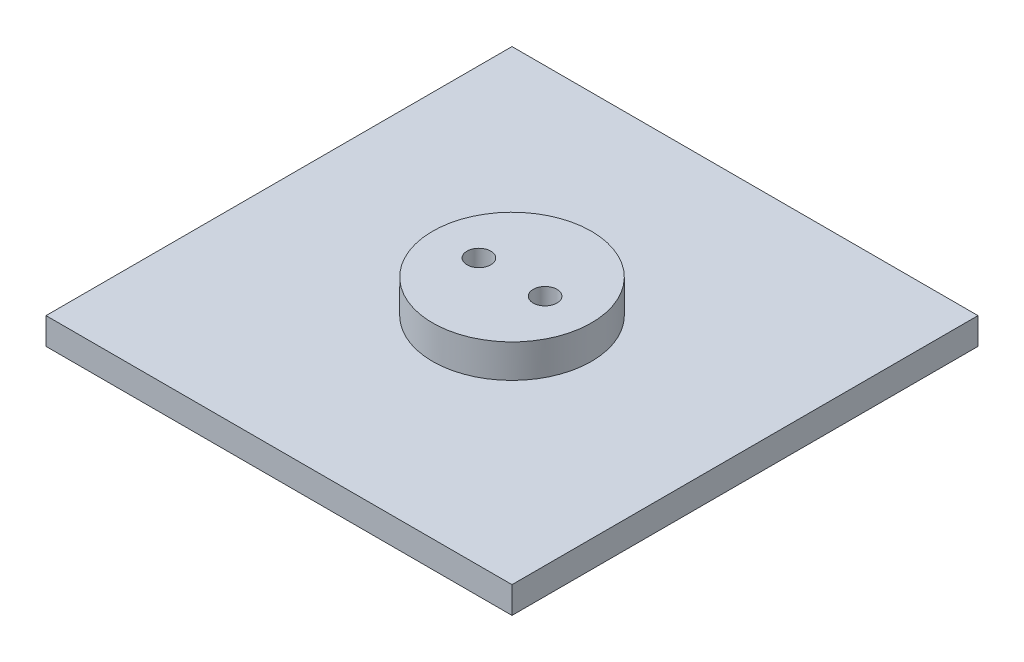
ISO-10303-21;
HEADER;
FILE_DESCRIPTION(('STEP AP214'),'2;1');
FILE_NAME('part.step','',(''),(''),'','','');
FILE_SCHEMA(('AUTOMOTIVE_DESIGN { 1 0 10303 214 1 1 1 1 }'));
ENDSEC;
DATA;
#1=APPLICATION_CONTEXT('core data for automotive mechanical design processes');
#2=APPLICATION_PROTOCOL_DEFINITION('international standard','automotive_design',2000,#1);
#3=PRODUCT_CONTEXT('',#1,'mechanical');
#4=PRODUCT('Part','Part','',(#3));
#5=PRODUCT_RELATED_PRODUCT_CATEGORY('part','',(#4));
#6=PRODUCT_DEFINITION_FORMATION('','',#4);
#7=PRODUCT_DEFINITION_CONTEXT('part definition',#1,'design');
#8=PRODUCT_DEFINITION('design','',#6,#7);
#9=PRODUCT_DEFINITION_SHAPE('','',#8);
#10=(LENGTH_UNIT() NAMED_UNIT(*) SI_UNIT(.MILLI.,.METRE.));
#11=(NAMED_UNIT(*) PLANE_ANGLE_UNIT() SI_UNIT($,.RADIAN.));
#12=(NAMED_UNIT(*) SI_UNIT($,.STERADIAN.) SOLID_ANGLE_UNIT());
#13=UNCERTAINTY_MEASURE_WITH_UNIT(LENGTH_MEASURE(1.E-05),#10,'distance_accuracy_value','');
#14=(GEOMETRIC_REPRESENTATION_CONTEXT(3) GLOBAL_UNCERTAINTY_ASSIGNED_CONTEXT((#13)) GLOBAL_UNIT_ASSIGNED_CONTEXT((#10,
#11,#12)) REPRESENTATION_CONTEXT('',''));
#15=CARTESIAN_POINT('',(0.,0.,0.));
#16=DIRECTION('',(0.,0.,1.));
#17=DIRECTION('',(1.,0.,0.));
#18=AXIS2_PLACEMENT_3D('',#15,#16,#17);
#19=CARTESIAN_POINT('',(0.,4.,0.));
#20=DIRECTION('',(1.,0.,0.));
#21=DIRECTION('',(0.,0.,-1.));
#22=AXIS2_PLACEMENT_3D('',#19,#20,#21);
#23=PLANE('',#22);
#24=DIRECTION('',(0.,0.,1.));
#25=VECTOR('',#24,1.);
#26=CARTESIAN_POINT('',(0.,0.,0.));
#27=LINE('',#26,#25);
#28=CARTESIAN_POINT('',(0.,0.,-69.85));
#29=VERTEX_POINT('',#28);
#30=CARTESIAN_POINT('',(0.,0.,0.));
#31=VERTEX_POINT('',#30);
#32=EDGE_CURVE('E101',#29,#31,#27,.T.);
#33=ORIENTED_EDGE('',*,*,#32,.T.);
#34=DIRECTION('',(0.,-1.,0.));
#35=VECTOR('',#34,1.);
#36=CARTESIAN_POINT('',(0.,4.,0.));
#37=LINE('',#36,#35);
#38=CARTESIAN_POINT('',(0.,4.,0.));
#39=VERTEX_POINT('',#38);
#40=EDGE_CURVE('E38',#39,#31,#37,.T.);
#41=ORIENTED_EDGE('',*,*,#40,.F.);
#42=DIRECTION('',(0.,0.,1.));
#43=VECTOR('',#42,1.);
#44=CARTESIAN_POINT('',(0.,4.,0.));
#45=LINE('',#44,#43);
#46=CARTESIAN_POINT('',(0.,4.,-69.85));
#47=VERTEX_POINT('',#46);
#48=EDGE_CURVE('E88',#47,#39,#45,.T.);
#49=ORIENTED_EDGE('',*,*,#48,.F.);
#50=DIRECTION('',(0.,-1.,0.));
#51=VECTOR('',#50,1.);
#52=CARTESIAN_POINT('',(0.,4.,-69.85));
#53=LINE('',#52,#51);
#54=EDGE_CURVE('E97',#47,#29,#53,.T.);
#55=ORIENTED_EDGE('',*,*,#54,.T.);
#56=EDGE_LOOP('',(#33,#41,#49,#55));
#57=FACE_BOUND('',#56,.T.);
#58=ADVANCED_FACE('F35',(#57),#23,.F.);
#59=CARTESIAN_POINT('',(0.,4.,0.));
#60=DIRECTION('',(0.,0.,-1.));
#61=DIRECTION('',(-1.,0.,0.));
#62=AXIS2_PLACEMENT_3D('',#59,#60,#61);
#63=PLANE('',#62);
#64=DIRECTION('',(1.,0.,0.));
#65=VECTOR('',#64,1.);
#66=CARTESIAN_POINT('',(0.,0.,0.));
#67=LINE('',#66,#65);
#68=CARTESIAN_POINT('',(69.85,0.,0.));
#69=VERTEX_POINT('',#68);
#70=EDGE_CURVE('E93',#31,#69,#67,.T.);
#71=ORIENTED_EDGE('',*,*,#70,.T.);
#72=DIRECTION('',(0.,-1.,0.));
#73=VECTOR('',#72,1.);
#74=CARTESIAN_POINT('',(69.85,4.,0.));
#75=LINE('',#74,#73);
#76=CARTESIAN_POINT('',(69.85,4.,0.));
#77=VERTEX_POINT('',#76);
#78=EDGE_CURVE('E91',#77,#69,#75,.T.);
#79=ORIENTED_EDGE('',*,*,#78,.F.);
#80=DIRECTION('',(1.,0.,0.));
#81=VECTOR('',#80,1.);
#82=CARTESIAN_POINT('',(0.,4.,0.));
#83=LINE('',#82,#81);
#84=EDGE_CURVE('E83',#39,#77,#83,.T.);
#85=ORIENTED_EDGE('',*,*,#84,.F.);
#86=ORIENTED_EDGE('',*,*,#40,.T.);
#87=EDGE_LOOP('',(#71,#79,#85,#86));
#88=FACE_BOUND('',#87,.T.);
#89=ADVANCED_FACE('F92',(#88),#63,.F.);
#90=CARTESIAN_POINT('',(69.85,4.,0.));
#91=DIRECTION('',(-1.,0.,0.));
#92=DIRECTION('',(0.,0.,1.));
#93=AXIS2_PLACEMENT_3D('',#90,#91,#92);
#94=PLANE('',#93);
#95=DIRECTION('',(0.,0.,-1.));
#96=VECTOR('',#95,1.);
#97=CARTESIAN_POINT('',(69.85,0.,0.));
#98=LINE('',#97,#96);
#99=CARTESIAN_POINT('',(69.85,0.,-69.85));
#100=VERTEX_POINT('',#99);
#101=EDGE_CURVE('E69',#69,#100,#98,.T.);
#102=ORIENTED_EDGE('',*,*,#101,.T.);
#103=DIRECTION('',(0.,-1.,0.));
#104=VECTOR('',#103,1.);
#105=CARTESIAN_POINT('',(69.85,4.,-69.85));
#106=LINE('',#105,#104);
#107=CARTESIAN_POINT('',(69.85,4.,-69.85));
#108=VERTEX_POINT('',#107);
#109=EDGE_CURVE('E94',#108,#100,#106,.T.);
#110=ORIENTED_EDGE('',*,*,#109,.F.);
#111=DIRECTION('',(0.,0.,-1.));
#112=VECTOR('',#111,1.);
#113=CARTESIAN_POINT('',(69.85,4.,0.));
#114=LINE('',#113,#112);
#115=EDGE_CURVE('E86',#77,#108,#114,.T.);
#116=ORIENTED_EDGE('',*,*,#115,.F.);
#117=ORIENTED_EDGE('',*,*,#78,.T.);
#118=EDGE_LOOP('',(#102,#110,#116,#117));
#119=FACE_BOUND('',#118,.T.);
#120=ADVANCED_FACE('F95',(#119),#94,.F.);
#121=CARTESIAN_POINT('',(0.,4.,-69.85));
#122=DIRECTION('',(0.,0.,1.));
#123=DIRECTION('',(1.,0.,0.));
#124=AXIS2_PLACEMENT_3D('',#121,#122,#123);
#125=PLANE('',#124);
#126=DIRECTION('',(-1.,0.,0.));
#127=VECTOR('',#126,1.);
#128=CARTESIAN_POINT('',(0.,0.,-69.85));
#129=LINE('',#128,#127);
#130=EDGE_CURVE('E75',#100,#29,#129,.T.);
#131=ORIENTED_EDGE('',*,*,#130,.T.);
#132=ORIENTED_EDGE('',*,*,#54,.F.);
#133=DIRECTION('',(-1.,0.,0.));
#134=VECTOR('',#133,1.);
#135=CARTESIAN_POINT('',(0.,4.,-69.85));
#136=LINE('',#135,#134);
#137=EDGE_CURVE('E52',#108,#47,#136,.T.);
#138=ORIENTED_EDGE('',*,*,#137,.F.);
#139=ORIENTED_EDGE('',*,*,#109,.T.);
#140=EDGE_LOOP('',(#131,#132,#138,#139));
#141=FACE_BOUND('',#140,.T.);
#142=ADVANCED_FACE('F109',(#141),#125,.F.);
#143=CARTESIAN_POINT('',(0.,4.,0.));
#144=DIRECTION('',(0.,-1.,0.));
#145=DIRECTION('',(0.,0.,-1.));
#146=AXIS2_PLACEMENT_3D('',#143,#144,#145);
#147=PLANE('',#146);
#148=CARTESIAN_POINT('',(34.925,4.,-34.925));
#149=DIRECTION('',(0.,1.,0.));
#150=DIRECTION('',(0.,0.,1.));
#151=AXIS2_PLACEMENT_3D('',#148,#149,#150);
#152=CIRCLE('',#151,11.90625);
#153=CARTESIAN_POINT('',(34.925,4.,-23.01875));
#154=VERTEX_POINT('',#153);
#155=EDGE_CURVE('E12',#154,#154,#152,.T.);
#156=ORIENTED_EDGE('',*,*,#155,.F.);
#157=EDGE_LOOP('',(#156));
#158=FACE_BOUND('',#157,.T.);
#159=ORIENTED_EDGE('',*,*,#48,.T.);
#160=ORIENTED_EDGE('',*,*,#84,.T.);
#161=ORIENTED_EDGE('',*,*,#115,.T.);
#162=ORIENTED_EDGE('',*,*,#137,.T.);
#163=EDGE_LOOP('',(#159,#160,#161,#162));
#164=FACE_BOUND('',#163,.T.);
#165=ADVANCED_FACE('F84',(#158,#164),#147,.F.);
#166=CARTESIAN_POINT('',(0.,0.,0.));
#167=DIRECTION('',(0.,-1.,0.));
#168=DIRECTION('',(0.,0.,-1.));
#169=AXIS2_PLACEMENT_3D('',#166,#167,#168);
#170=PLANE('',#169);
#171=CARTESIAN_POINT('',(29.9640625,0.,-34.925));
#172=DIRECTION('',(0.,-1.,0.));
#173=DIRECTION('',(0.,0.,-1.));
#174=AXIS2_PLACEMENT_3D('',#171,#172,#173);
#175=CIRCLE('',#174,1.7859375);
#176=CARTESIAN_POINT('',(29.9640625,0.,-36.7109375));
#177=VERTEX_POINT('',#176);
#178=EDGE_CURVE('E116',#177,#177,#175,.F.);
#179=ORIENTED_EDGE('',*,*,#178,.T.);
#180=EDGE_LOOP('',(#179));
#181=FACE_BOUND('',#180,.T.);
#182=CARTESIAN_POINT('',(39.8859375,0.,-34.925));
#183=DIRECTION('',(0.,-1.,0.));
#184=DIRECTION('',(0.,0.,-1.));
#185=AXIS2_PLACEMENT_3D('',#182,#183,#184);
#186=CIRCLE('',#185,1.7859375);
#187=CARTESIAN_POINT('',(39.8859375,0.,-36.7109375));
#188=VERTEX_POINT('',#187);
#189=EDGE_CURVE('E118',#188,#188,#186,.F.);
#190=ORIENTED_EDGE('',*,*,#189,.T.);
#191=EDGE_LOOP('',(#190));
#192=FACE_BOUND('',#191,.T.);
#193=ORIENTED_EDGE('',*,*,#32,.F.);
#194=ORIENTED_EDGE('',*,*,#130,.F.);
#195=ORIENTED_EDGE('',*,*,#101,.F.);
#196=ORIENTED_EDGE('',*,*,#70,.F.);
#197=EDGE_LOOP('',(#193,#194,#195,#196));
#198=FACE_BOUND('',#197,.T.);
#199=ADVANCED_FACE('F112',(#181,#192,#198),#170,.T.);
#200=CARTESIAN_POINT('',(34.925,51.6759604540093,-34.925));
#201=DIRECTION('',(0.,-1.,0.));
#202=DIRECTION('',(0.,0.,-1.));
#203=AXIS2_PLACEMENT_3D('',#200,#201,#202);
#204=CYLINDRICAL_SURFACE('',#203,11.90625);
#205=CARTESIAN_POINT('',(34.925,9.,-34.925));
#206=DIRECTION('',(0.,-1.,0.));
#207=DIRECTION('',(0.,0.,-1.));
#208=AXIS2_PLACEMENT_3D('',#205,#206,#207);
#209=CIRCLE('',#208,11.90625);
#210=CARTESIAN_POINT('',(34.925,9.,-46.83125));
#211=VERTEX_POINT('',#210);
#212=EDGE_CURVE('E104',#211,#211,#209,.T.);
#213=ORIENTED_EDGE('',*,*,#212,.T.);
#214=EDGE_LOOP('',(#213));
#215=FACE_BOUND('',#214,.T.);
#216=ORIENTED_EDGE('',*,*,#155,.T.);
#217=EDGE_LOOP('',(#216));
#218=FACE_BOUND('',#217,.T.);
#219=ADVANCED_FACE('F137',(#215,#218),#204,.T.);
#220=CARTESIAN_POINT('',(0.,9.,0.));
#221=DIRECTION('',(0.,-1.,0.));
#222=DIRECTION('',(0.,0.,-1.));
#223=AXIS2_PLACEMENT_3D('',#220,#221,#222);
#224=PLANE('',#223);
#225=CARTESIAN_POINT('',(29.9640625,9.,-34.925));
#226=DIRECTION('',(0.,1.,0.));
#227=DIRECTION('',(0.,0.,1.));
#228=AXIS2_PLACEMENT_3D('',#225,#226,#227);
#229=CIRCLE('',#228,1.7859375);
#230=CARTESIAN_POINT('',(29.9640625,9.,-33.1390625));
#231=VERTEX_POINT('',#230);
#232=EDGE_CURVE('E121',#231,#231,#229,.T.);
#233=ORIENTED_EDGE('',*,*,#232,.F.);
#234=EDGE_LOOP('',(#233));
#235=FACE_BOUND('',#234,.T.);
#236=CARTESIAN_POINT('',(39.8859375,9.,-34.925));
#237=DIRECTION('',(0.,1.,0.));
#238=DIRECTION('',(0.,0.,1.));
#239=AXIS2_PLACEMENT_3D('',#236,#237,#238);
#240=CIRCLE('',#239,1.7859375);
#241=CARTESIAN_POINT('',(39.8859375,9.,-33.1390625));
#242=VERTEX_POINT('',#241);
#243=EDGE_CURVE('E122',#242,#242,#240,.T.);
#244=ORIENTED_EDGE('',*,*,#243,.F.);
#245=EDGE_LOOP('',(#244));
#246=FACE_BOUND('',#245,.T.);
#247=ORIENTED_EDGE('',*,*,#212,.F.);
#248=EDGE_LOOP('',(#247));
#249=FACE_BOUND('',#248,.T.);
#250=ADVANCED_FACE('F133',(#235,#246,#249),#224,.F.);
#251=CARTESIAN_POINT('',(39.8859375,-5.0513940681014,-34.925));
#252=DIRECTION('',(0.,1.,0.));
#253=DIRECTION('',(0.,0.,1.));
#254=AXIS2_PLACEMENT_3D('',#251,#252,#253);
#255=CYLINDRICAL_SURFACE('',#254,1.7859375);
#256=ORIENTED_EDGE('',*,*,#243,.T.);
#257=EDGE_LOOP('',(#256));
#258=FACE_BOUND('',#257,.T.);
#259=ORIENTED_EDGE('',*,*,#189,.F.);
#260=EDGE_LOOP('',(#259));
#261=FACE_BOUND('',#260,.T.);
#262=ADVANCED_FACE('F136',(#258,#261),#255,.F.);
#263=CARTESIAN_POINT('',(29.9640625,-5.0513940681014,-34.925));
#264=DIRECTION('',(0.,1.,0.));
#265=DIRECTION('',(0.,0.,1.));
#266=AXIS2_PLACEMENT_3D('',#263,#264,#265);
#267=CYLINDRICAL_SURFACE('',#266,1.7859375);
#268=ORIENTED_EDGE('',*,*,#232,.T.);
#269=EDGE_LOOP('',(#268));
#270=FACE_BOUND('',#269,.T.);
#271=ORIENTED_EDGE('',*,*,#178,.F.);
#272=EDGE_LOOP('',(#271));
#273=FACE_BOUND('',#272,.T.);
#274=ADVANCED_FACE('F130',(#270,#273),#267,.F.);
#275=CLOSED_SHELL('',(#58,#89,#120,#142,#165,#199,#219,#250,#262,#274));
#276=MANIFOLD_SOLID_BREP('B2',#275);
#277=ADVANCED_BREP_SHAPE_REPRESENTATION('',(#18,#276),#14);
#278=SHAPE_DEFINITION_REPRESENTATION(#9,#277);
ENDSEC;
END-ISO-10303-21;
